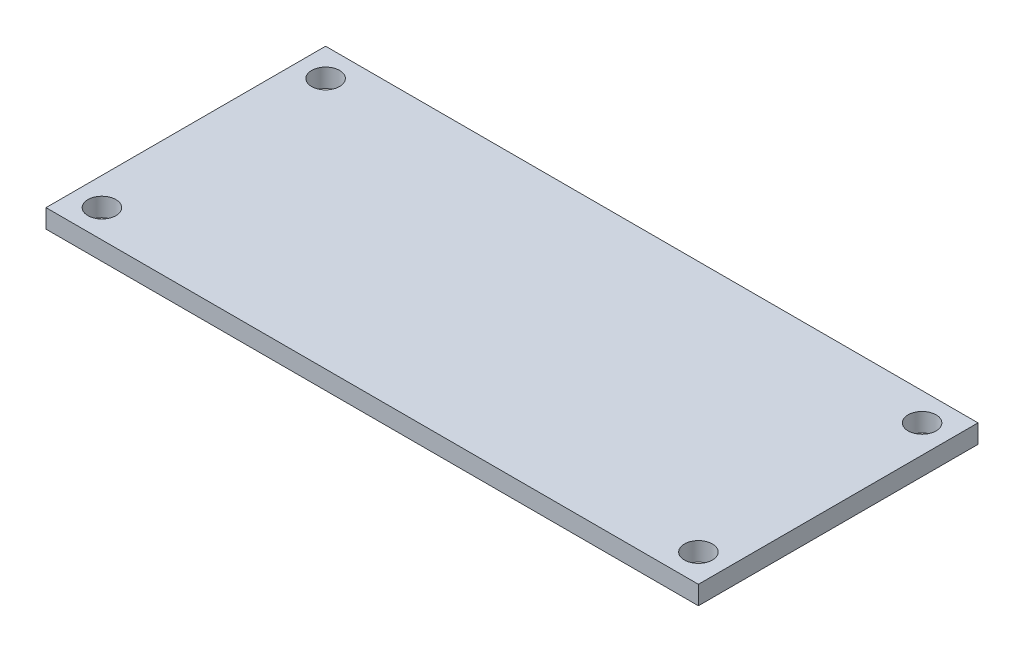
ISO-10303-21;
HEADER;
FILE_DESCRIPTION(('STEP AP214'),'2;1');
FILE_NAME('part.step','',(''),(''),'','','');
FILE_SCHEMA(('AUTOMOTIVE_DESIGN { 1 0 10303 214 1 1 1 1 }'));
ENDSEC;
DATA;
#1=APPLICATION_CONTEXT('core data for automotive mechanical design processes');
#2=APPLICATION_PROTOCOL_DEFINITION('international standard','automotive_design',2000,#1);
#3=PRODUCT_CONTEXT('',#1,'mechanical');
#4=PRODUCT('Part','Part','',(#3));
#5=PRODUCT_RELATED_PRODUCT_CATEGORY('part','',(#4));
#6=PRODUCT_DEFINITION_FORMATION('','',#4);
#7=PRODUCT_DEFINITION_CONTEXT('part definition',#1,'design');
#8=PRODUCT_DEFINITION('design','',#6,#7);
#9=PRODUCT_DEFINITION_SHAPE('','',#8);
#10=(LENGTH_UNIT() NAMED_UNIT(*) SI_UNIT(.MILLI.,.METRE.));
#11=(NAMED_UNIT(*) PLANE_ANGLE_UNIT() SI_UNIT($,.RADIAN.));
#12=(NAMED_UNIT(*) SI_UNIT($,.STERADIAN.) SOLID_ANGLE_UNIT());
#13=UNCERTAINTY_MEASURE_WITH_UNIT(LENGTH_MEASURE(1.E-05),#10,'distance_accuracy_value','');
#14=(GEOMETRIC_REPRESENTATION_CONTEXT(3) GLOBAL_UNCERTAINTY_ASSIGNED_CONTEXT((#13)) GLOBAL_UNIT_ASSIGNED_CONTEXT((#10,
#11,#12)) REPRESENTATION_CONTEXT('',''));
#15=CARTESIAN_POINT('',(0.,0.,0.));
#16=DIRECTION('',(0.,0.,1.));
#17=DIRECTION('',(1.,0.,0.));
#18=AXIS2_PLACEMENT_3D('',#15,#16,#17);
#19=CARTESIAN_POINT('',(-35.,2.,-15.));
#20=DIRECTION('',(1.,0.,0.));
#21=DIRECTION('',(0.,0.,-1.));
#22=AXIS2_PLACEMENT_3D('',#19,#20,#21);
#23=PLANE('',#22);
#24=DIRECTION('',(0.,0.,1.));
#25=VECTOR('',#24,1.);
#26=CARTESIAN_POINT('',(-35.,0.,-15.));
#27=LINE('',#26,#25);
#28=CARTESIAN_POINT('',(-35.,0.,-15.));
#29=VERTEX_POINT('',#28);
#30=CARTESIAN_POINT('',(-35.,0.,15.));
#31=VERTEX_POINT('',#30);
#32=EDGE_CURVE('E96',#29,#31,#27,.T.);
#33=ORIENTED_EDGE('',*,*,#32,.T.);
#34=DIRECTION('',(0.,-1.,0.));
#35=VECTOR('',#34,1.);
#36=CARTESIAN_POINT('',(-35.,2.,15.));
#37=LINE('',#36,#35);
#38=CARTESIAN_POINT('',(-35.,2.,15.));
#39=VERTEX_POINT('',#38);
#40=EDGE_CURVE('E11',#39,#31,#37,.T.);
#41=ORIENTED_EDGE('',*,*,#40,.F.);
#42=DIRECTION('',(0.,0.,1.));
#43=VECTOR('',#42,1.);
#44=CARTESIAN_POINT('',(-35.,2.,-15.));
#45=LINE('',#44,#43);
#46=CARTESIAN_POINT('',(-35.,2.,-15.));
#47=VERTEX_POINT('',#46);
#48=EDGE_CURVE('E84',#47,#39,#45,.T.);
#49=ORIENTED_EDGE('',*,*,#48,.F.);
#50=DIRECTION('',(0.,-1.,0.));
#51=VECTOR('',#50,1.);
#52=CARTESIAN_POINT('',(-35.,2.,-15.));
#53=LINE('',#52,#51);
#54=EDGE_CURVE('E92',#47,#29,#53,.T.);
#55=ORIENTED_EDGE('',*,*,#54,.T.);
#56=EDGE_LOOP('',(#33,#41,#49,#55));
#57=FACE_BOUND('',#56,.T.);
#58=ADVANCED_FACE('F33',(#57),#23,.F.);
#59=CARTESIAN_POINT('',(35.,2.,15.));
#60=DIRECTION('',(0.,0.,-1.));
#61=DIRECTION('',(-1.,0.,0.));
#62=AXIS2_PLACEMENT_3D('',#59,#60,#61);
#63=PLANE('',#62);
#64=DIRECTION('',(1.,0.,0.));
#65=VECTOR('',#64,1.);
#66=CARTESIAN_POINT('',(35.,0.,15.));
#67=LINE('',#66,#65);
#68=CARTESIAN_POINT('',(35.,0.,15.));
#69=VERTEX_POINT('',#68);
#70=EDGE_CURVE('E88',#31,#69,#67,.T.);
#71=ORIENTED_EDGE('',*,*,#70,.T.);
#72=DIRECTION('',(0.,-1.,0.));
#73=VECTOR('',#72,1.);
#74=CARTESIAN_POINT('',(35.,2.,15.));
#75=LINE('',#74,#73);
#76=CARTESIAN_POINT('',(35.,2.,15.));
#77=VERTEX_POINT('',#76);
#78=EDGE_CURVE('E41',#77,#69,#75,.T.);
#79=ORIENTED_EDGE('',*,*,#78,.F.);
#80=DIRECTION('',(1.,0.,0.));
#81=VECTOR('',#80,1.);
#82=CARTESIAN_POINT('',(35.,2.,15.));
#83=LINE('',#82,#81);
#84=EDGE_CURVE('E79',#39,#77,#83,.T.);
#85=ORIENTED_EDGE('',*,*,#84,.F.);
#86=ORIENTED_EDGE('',*,*,#40,.T.);
#87=EDGE_LOOP('',(#71,#79,#85,#86));
#88=FACE_BOUND('',#87,.T.);
#89=ADVANCED_FACE('F87',(#88),#63,.F.);
#90=CARTESIAN_POINT('',(35.,2.,-15.));
#91=DIRECTION('',(-1.,0.,0.));
#92=DIRECTION('',(0.,0.,1.));
#93=AXIS2_PLACEMENT_3D('',#90,#91,#92);
#94=PLANE('',#93);
#95=DIRECTION('',(0.,0.,-1.));
#96=VECTOR('',#95,1.);
#97=CARTESIAN_POINT('',(35.,0.,-15.));
#98=LINE('',#97,#96);
#99=CARTESIAN_POINT('',(35.,0.,-15.));
#100=VERTEX_POINT('',#99);
#101=EDGE_CURVE('E66',#69,#100,#98,.T.);
#102=ORIENTED_EDGE('',*,*,#101,.T.);
#103=DIRECTION('',(0.,-1.,0.));
#104=VECTOR('',#103,1.);
#105=CARTESIAN_POINT('',(35.,2.,-15.));
#106=LINE('',#105,#104);
#107=CARTESIAN_POINT('',(35.,2.,-15.));
#108=VERTEX_POINT('',#107);
#109=EDGE_CURVE('E89',#108,#100,#106,.T.);
#110=ORIENTED_EDGE('',*,*,#109,.F.);
#111=DIRECTION('',(0.,0.,-1.));
#112=VECTOR('',#111,1.);
#113=CARTESIAN_POINT('',(35.,2.,-15.));
#114=LINE('',#113,#112);
#115=EDGE_CURVE('E82',#77,#108,#114,.T.);
#116=ORIENTED_EDGE('',*,*,#115,.F.);
#117=ORIENTED_EDGE('',*,*,#78,.T.);
#118=EDGE_LOOP('',(#102,#110,#116,#117));
#119=FACE_BOUND('',#118,.T.);
#120=ADVANCED_FACE('F90',(#119),#94,.F.);
#121=CARTESIAN_POINT('',(35.,2.,-15.));
#122=DIRECTION('',(0.,0.,1.));
#123=DIRECTION('',(1.,0.,0.));
#124=AXIS2_PLACEMENT_3D('',#121,#122,#123);
#125=PLANE('',#124);
#126=DIRECTION('',(-1.,0.,0.));
#127=VECTOR('',#126,1.);
#128=CARTESIAN_POINT('',(35.,0.,-15.));
#129=LINE('',#128,#127);
#130=EDGE_CURVE('E72',#100,#29,#129,.T.);
#131=ORIENTED_EDGE('',*,*,#130,.T.);
#132=ORIENTED_EDGE('',*,*,#54,.F.);
#133=DIRECTION('',(-1.,0.,0.));
#134=VECTOR('',#133,1.);
#135=CARTESIAN_POINT('',(35.,2.,-15.));
#136=LINE('',#135,#134);
#137=EDGE_CURVE('E49',#108,#47,#136,.T.);
#138=ORIENTED_EDGE('',*,*,#137,.F.);
#139=ORIENTED_EDGE('',*,*,#109,.T.);
#140=EDGE_LOOP('',(#131,#132,#138,#139));
#141=FACE_BOUND('',#140,.T.);
#142=ADVANCED_FACE('F104',(#141),#125,.F.);
#143=CARTESIAN_POINT('',(0.,2.,0.));
#144=DIRECTION('',(0.,-1.,0.));
#145=DIRECTION('',(0.,0.,-1.));
#146=AXIS2_PLACEMENT_3D('',#143,#144,#145);
#147=PLANE('',#146);
#148=CARTESIAN_POINT('',(32.,2.,-12.));
#149=DIRECTION('',(0.,1.,0.));
#150=DIRECTION('',(0.,0.,-1.));
#151=AXIS2_PLACEMENT_3D('',#148,#149,#150);
#152=CIRCLE('',#151,1.5);
#153=CARTESIAN_POINT('',(32.,2.,-13.5));
#154=VERTEX_POINT('',#153);
#155=EDGE_CURVE('E116',#154,#154,#152,.T.);
#156=ORIENTED_EDGE('',*,*,#155,.F.);
#157=EDGE_LOOP('',(#156));
#158=FACE_BOUND('',#157,.T.);
#159=CARTESIAN_POINT('',(32.,2.,12.));
#160=DIRECTION('',(0.,1.,0.));
#161=DIRECTION('',(0.,0.,-1.));
#162=AXIS2_PLACEMENT_3D('',#159,#160,#161);
#163=CIRCLE('',#162,1.5);
#164=CARTESIAN_POINT('',(32.,2.,10.5));
#165=VERTEX_POINT('',#164);
#166=EDGE_CURVE('E122',#165,#165,#163,.T.);
#167=ORIENTED_EDGE('',*,*,#166,.F.);
#168=EDGE_LOOP('',(#167));
#169=FACE_BOUND('',#168,.T.);
#170=CARTESIAN_POINT('',(-32.,2.,12.));
#171=DIRECTION('',(0.,1.,0.));
#172=DIRECTION('',(0.,0.,1.));
#173=AXIS2_PLACEMENT_3D('',#170,#171,#172);
#174=CIRCLE('',#173,1.5);
#175=CARTESIAN_POINT('',(-32.,2.,13.5));
#176=VERTEX_POINT('',#175);
#177=EDGE_CURVE('E128',#176,#176,#174,.T.);
#178=ORIENTED_EDGE('',*,*,#177,.F.);
#179=EDGE_LOOP('',(#178));
#180=FACE_BOUND('',#179,.T.);
#181=CARTESIAN_POINT('',(-32.,2.,-12.));
#182=DIRECTION('',(0.,1.,0.));
#183=DIRECTION('',(0.,0.,1.));
#184=AXIS2_PLACEMENT_3D('',#181,#182,#183);
#185=CIRCLE('',#184,1.5);
#186=CARTESIAN_POINT('',(-32.,2.,-10.5));
#187=VERTEX_POINT('',#186);
#188=EDGE_CURVE('E110',#187,#187,#185,.T.);
#189=ORIENTED_EDGE('',*,*,#188,.F.);
#190=EDGE_LOOP('',(#189));
#191=FACE_BOUND('',#190,.T.);
#192=ORIENTED_EDGE('',*,*,#48,.T.);
#193=ORIENTED_EDGE('',*,*,#84,.T.);
#194=ORIENTED_EDGE('',*,*,#115,.T.);
#195=ORIENTED_EDGE('',*,*,#137,.T.);
#196=EDGE_LOOP('',(#192,#193,#194,#195));
#197=FACE_BOUND('',#196,.T.);
#198=ADVANCED_FACE('F80',(#158,#169,#180,#191,#197),#147,.F.);
#199=CARTESIAN_POINT('',(0.,0.,0.));
#200=DIRECTION('',(0.,-1.,0.));
#201=DIRECTION('',(0.,0.,-1.));
#202=AXIS2_PLACEMENT_3D('',#199,#200,#201);
#203=PLANE('',#202);
#204=CARTESIAN_POINT('',(32.,0.,-12.));
#205=DIRECTION('',(0.,1.,0.));
#206=DIRECTION('',(0.,0.,-1.));
#207=AXIS2_PLACEMENT_3D('',#204,#205,#206);
#208=CIRCLE('',#207,1.5);
#209=CARTESIAN_POINT('',(32.,0.,-13.5));
#210=VERTEX_POINT('',#209);
#211=EDGE_CURVE('E119',#210,#210,#208,.T.);
#212=ORIENTED_EDGE('',*,*,#211,.T.);
#213=EDGE_LOOP('',(#212));
#214=FACE_BOUND('',#213,.T.);
#215=CARTESIAN_POINT('',(32.,0.,12.));
#216=DIRECTION('',(0.,1.,0.));
#217=DIRECTION('',(0.,0.,-1.));
#218=AXIS2_PLACEMENT_3D('',#215,#216,#217);
#219=CIRCLE('',#218,1.5);
#220=CARTESIAN_POINT('',(32.,0.,10.5));
#221=VERTEX_POINT('',#220);
#222=EDGE_CURVE('E125',#221,#221,#219,.T.);
#223=ORIENTED_EDGE('',*,*,#222,.T.);
#224=EDGE_LOOP('',(#223));
#225=FACE_BOUND('',#224,.T.);
#226=CARTESIAN_POINT('',(-32.,0.,12.));
#227=DIRECTION('',(0.,1.,0.));
#228=DIRECTION('',(0.,0.,1.));
#229=AXIS2_PLACEMENT_3D('',#226,#227,#228);
#230=CIRCLE('',#229,1.5);
#231=CARTESIAN_POINT('',(-32.,0.,13.5));
#232=VERTEX_POINT('',#231);
#233=EDGE_CURVE('E113',#232,#232,#230,.T.);
#234=ORIENTED_EDGE('',*,*,#233,.T.);
#235=EDGE_LOOP('',(#234));
#236=FACE_BOUND('',#235,.T.);
#237=CARTESIAN_POINT('',(-32.,0.,-12.));
#238=DIRECTION('',(0.,1.,0.));
#239=DIRECTION('',(0.,0.,1.));
#240=AXIS2_PLACEMENT_3D('',#237,#238,#239);
#241=CIRCLE('',#240,1.5);
#242=CARTESIAN_POINT('',(-32.,0.,-10.5));
#243=VERTEX_POINT('',#242);
#244=EDGE_CURVE('E99',#243,#243,#241,.T.);
#245=ORIENTED_EDGE('',*,*,#244,.T.);
#246=EDGE_LOOP('',(#245));
#247=FACE_BOUND('',#246,.T.);
#248=ORIENTED_EDGE('',*,*,#32,.F.);
#249=ORIENTED_EDGE('',*,*,#130,.F.);
#250=ORIENTED_EDGE('',*,*,#101,.F.);
#251=ORIENTED_EDGE('',*,*,#70,.F.);
#252=EDGE_LOOP('',(#248,#249,#250,#251));
#253=FACE_BOUND('',#252,.T.);
#254=ADVANCED_FACE('F107',(#214,#225,#236,#247,#253),#203,.T.);
#255=CARTESIAN_POINT('',(-32.,0.,-12.));
#256=DIRECTION('',(0.,1.,0.));
#257=DIRECTION('',(0.,0.,1.));
#258=AXIS2_PLACEMENT_3D('',#255,#256,#257);
#259=CYLINDRICAL_SURFACE('',#258,1.5);
#260=ORIENTED_EDGE('',*,*,#244,.F.);
#261=EDGE_LOOP('',(#260));
#262=FACE_BOUND('',#261,.T.);
#263=ORIENTED_EDGE('',*,*,#188,.T.);
#264=EDGE_LOOP('',(#263));
#265=FACE_BOUND('',#264,.T.);
#266=ADVANCED_FACE('F140',(#262,#265),#259,.F.);
#267=CARTESIAN_POINT('',(-32.,0.,12.));
#268=DIRECTION('',(0.,1.,0.));
#269=DIRECTION('',(0.,0.,1.));
#270=AXIS2_PLACEMENT_3D('',#267,#268,#269);
#271=CYLINDRICAL_SURFACE('',#270,1.5);
#272=ORIENTED_EDGE('',*,*,#233,.F.);
#273=EDGE_LOOP('',(#272));
#274=FACE_BOUND('',#273,.T.);
#275=ORIENTED_EDGE('',*,*,#177,.T.);
#276=EDGE_LOOP('',(#275));
#277=FACE_BOUND('',#276,.T.);
#278=ADVANCED_FACE('F136',(#274,#277),#271,.F.);
#279=CARTESIAN_POINT('',(32.,0.,12.));
#280=DIRECTION('',(0.,1.,0.));
#281=DIRECTION('',(0.,0.,1.));
#282=AXIS2_PLACEMENT_3D('',#279,#280,#281);
#283=CYLINDRICAL_SURFACE('',#282,1.5);
#284=ORIENTED_EDGE('',*,*,#222,.F.);
#285=EDGE_LOOP('',(#284));
#286=FACE_BOUND('',#285,.T.);
#287=ORIENTED_EDGE('',*,*,#166,.T.);
#288=EDGE_LOOP('',(#287));
#289=FACE_BOUND('',#288,.T.);
#290=ADVANCED_FACE('F139',(#286,#289),#283,.F.);
#291=CARTESIAN_POINT('',(32.,0.,-12.));
#292=DIRECTION('',(0.,1.,0.));
#293=DIRECTION('',(0.,0.,1.));
#294=AXIS2_PLACEMENT_3D('',#291,#292,#293);
#295=CYLINDRICAL_SURFACE('',#294,1.5);
#296=ORIENTED_EDGE('',*,*,#211,.F.);
#297=EDGE_LOOP('',(#296));
#298=FACE_BOUND('',#297,.T.);
#299=ORIENTED_EDGE('',*,*,#155,.T.);
#300=EDGE_LOOP('',(#299));
#301=FACE_BOUND('',#300,.T.);
#302=ADVANCED_FACE('F201',(#298,#301),#295,.F.);
#303=CLOSED_SHELL('',(#58,#89,#120,#142,#198,#254,#266,#278,#290,#302));
#304=MANIFOLD_SOLID_BREP('B2',#303);
#305=ADVANCED_BREP_SHAPE_REPRESENTATION('',(#18,#304),#14);
#306=SHAPE_DEFINITION_REPRESENTATION(#9,#305);
ENDSEC;
END-ISO-10303-21;
